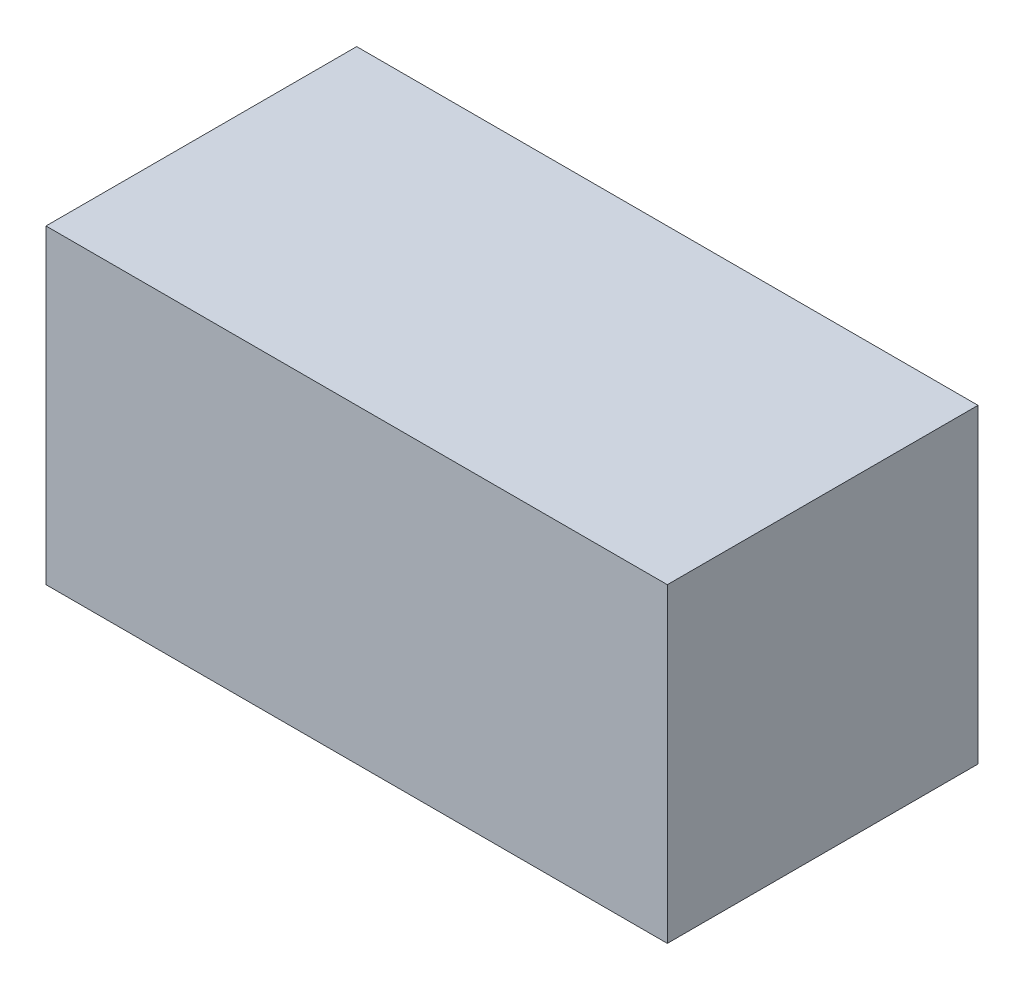
ISO-10303-21;
HEADER;
FILE_DESCRIPTION(('STEP AP214'),'2;1');
FILE_NAME('part.step','',(''),(''),'','','');
FILE_SCHEMA(('AUTOMOTIVE_DESIGN { 1 0 10303 214 1 1 1 1 }'));
ENDSEC;
DATA;
#1=APPLICATION_CONTEXT('core data for automotive mechanical design processes');
#2=APPLICATION_PROTOCOL_DEFINITION('international standard','automotive_design',2000,#1);
#3=PRODUCT_CONTEXT('',#1,'mechanical');
#4=PRODUCT('Part','Part','',(#3));
#5=PRODUCT_RELATED_PRODUCT_CATEGORY('part','',(#4));
#6=PRODUCT_DEFINITION_FORMATION('','',#4);
#7=PRODUCT_DEFINITION_CONTEXT('part definition',#1,'design');
#8=PRODUCT_DEFINITION('design','',#6,#7);
#9=PRODUCT_DEFINITION_SHAPE('','',#8);
#10=(LENGTH_UNIT() NAMED_UNIT(*) SI_UNIT(.MILLI.,.METRE.));
#11=(NAMED_UNIT(*) PLANE_ANGLE_UNIT() SI_UNIT($,.RADIAN.));
#12=(NAMED_UNIT(*) SI_UNIT($,.STERADIAN.) SOLID_ANGLE_UNIT());
#13=UNCERTAINTY_MEASURE_WITH_UNIT(LENGTH_MEASURE(1.E-05),#10,'distance_accuracy_value','');
#14=(GEOMETRIC_REPRESENTATION_CONTEXT(3) GLOBAL_UNCERTAINTY_ASSIGNED_CONTEXT((#13)) GLOBAL_UNIT_ASSIGNED_CONTEXT((#10,
#11,#12)) REPRESENTATION_CONTEXT('',''));
#15=CARTESIAN_POINT('',(0.,0.,0.));
#16=DIRECTION('',(0.,0.,1.));
#17=DIRECTION('',(1.,0.,0.));
#18=AXIS2_PLACEMENT_3D('',#15,#16,#17);
#19=CARTESIAN_POINT('',(-10.,5.,5.));
#20=DIRECTION('',(1.,0.,0.));
#21=DIRECTION('',(0.,0.,-1.));
#22=AXIS2_PLACEMENT_3D('',#19,#20,#21);
#23=PLANE('',#22);
#24=DIRECTION('',(0.,0.,1.));
#25=VECTOR('',#24,1.);
#26=CARTESIAN_POINT('',(-10.,-5.,5.));
#27=LINE('',#26,#25);
#28=CARTESIAN_POINT('',(-10.,-5.,-5.));
#29=VERTEX_POINT('',#28);
#30=CARTESIAN_POINT('',(-10.,-5.,5.));
#31=VERTEX_POINT('',#30);
#32=EDGE_CURVE('E96',#29,#31,#27,.T.);
#33=ORIENTED_EDGE('',*,*,#32,.T.);
#34=DIRECTION('',(0.,-1.,0.));
#35=VECTOR('',#34,1.);
#36=CARTESIAN_POINT('',(-10.,5.,5.));
#37=LINE('',#36,#35);
#38=CARTESIAN_POINT('',(-10.,5.,5.));
#39=VERTEX_POINT('',#38);
#40=EDGE_CURVE('E11',#39,#31,#37,.T.);
#41=ORIENTED_EDGE('',*,*,#40,.F.);
#42=DIRECTION('',(0.,0.,1.));
#43=VECTOR('',#42,1.);
#44=CARTESIAN_POINT('',(-10.,5.,5.));
#45=LINE('',#44,#43);
#46=CARTESIAN_POINT('',(-10.,5.,-5.));
#47=VERTEX_POINT('',#46);
#48=EDGE_CURVE('E84',#47,#39,#45,.T.);
#49=ORIENTED_EDGE('',*,*,#48,.F.);
#50=DIRECTION('',(0.,-1.,0.));
#51=VECTOR('',#50,1.);
#52=CARTESIAN_POINT('',(-10.,5.,-5.));
#53=LINE('',#52,#51);
#54=EDGE_CURVE('E92',#47,#29,#53,.T.);
#55=ORIENTED_EDGE('',*,*,#54,.T.);
#56=EDGE_LOOP('',(#33,#41,#49,#55));
#57=FACE_BOUND('',#56,.T.);
#58=ADVANCED_FACE('F33',(#57),#23,.F.);
#59=CARTESIAN_POINT('',(10.,5.,5.));
#60=DIRECTION('',(0.,0.,-1.));
#61=DIRECTION('',(-1.,0.,0.));
#62=AXIS2_PLACEMENT_3D('',#59,#60,#61);
#63=PLANE('',#62);
#64=DIRECTION('',(1.,0.,0.));
#65=VECTOR('',#64,1.);
#66=CARTESIAN_POINT('',(10.,-5.,5.));
#67=LINE('',#66,#65);
#68=CARTESIAN_POINT('',(10.,-5.,5.));
#69=VERTEX_POINT('',#68);
#70=EDGE_CURVE('E88',#31,#69,#67,.T.);
#71=ORIENTED_EDGE('',*,*,#70,.T.);
#72=DIRECTION('',(0.,-1.,0.));
#73=VECTOR('',#72,1.);
#74=CARTESIAN_POINT('',(10.,5.,5.));
#75=LINE('',#74,#73);
#76=CARTESIAN_POINT('',(10.,5.,5.));
#77=VERTEX_POINT('',#76);
#78=EDGE_CURVE('E41',#77,#69,#75,.T.);
#79=ORIENTED_EDGE('',*,*,#78,.F.);
#80=DIRECTION('',(1.,0.,0.));
#81=VECTOR('',#80,1.);
#82=CARTESIAN_POINT('',(10.,5.,5.));
#83=LINE('',#82,#81);
#84=EDGE_CURVE('E79',#39,#77,#83,.T.);
#85=ORIENTED_EDGE('',*,*,#84,.F.);
#86=ORIENTED_EDGE('',*,*,#40,.T.);
#87=EDGE_LOOP('',(#71,#79,#85,#86));
#88=FACE_BOUND('',#87,.T.);
#89=ADVANCED_FACE('F87',(#88),#63,.F.);
#90=CARTESIAN_POINT('',(10.,5.,5.));
#91=DIRECTION('',(-1.,0.,0.));
#92=DIRECTION('',(0.,0.,1.));
#93=AXIS2_PLACEMENT_3D('',#90,#91,#92);
#94=PLANE('',#93);
#95=DIRECTION('',(0.,0.,-1.));
#96=VECTOR('',#95,1.);
#97=CARTESIAN_POINT('',(10.,-5.,5.));
#98=LINE('',#97,#96);
#99=CARTESIAN_POINT('',(10.,-5.,-5.));
#100=VERTEX_POINT('',#99);
#101=EDGE_CURVE('E66',#69,#100,#98,.T.);
#102=ORIENTED_EDGE('',*,*,#101,.T.);
#103=DIRECTION('',(0.,-1.,0.));
#104=VECTOR('',#103,1.);
#105=CARTESIAN_POINT('',(10.,5.,-5.));
#106=LINE('',#105,#104);
#107=CARTESIAN_POINT('',(10.,5.,-5.));
#108=VERTEX_POINT('',#107);
#109=EDGE_CURVE('E89',#108,#100,#106,.T.);
#110=ORIENTED_EDGE('',*,*,#109,.F.);
#111=DIRECTION('',(0.,0.,-1.));
#112=VECTOR('',#111,1.);
#113=CARTESIAN_POINT('',(10.,5.,5.));
#114=LINE('',#113,#112);
#115=EDGE_CURVE('E82',#77,#108,#114,.T.);
#116=ORIENTED_EDGE('',*,*,#115,.F.);
#117=ORIENTED_EDGE('',*,*,#78,.T.);
#118=EDGE_LOOP('',(#102,#110,#116,#117));
#119=FACE_BOUND('',#118,.T.);
#120=ADVANCED_FACE('F90',(#119),#94,.F.);
#121=CARTESIAN_POINT('',(10.,5.,-5.));
#122=DIRECTION('',(0.,0.,1.));
#123=DIRECTION('',(1.,0.,0.));
#124=AXIS2_PLACEMENT_3D('',#121,#122,#123);
#125=PLANE('',#124);
#126=DIRECTION('',(-1.,0.,0.));
#127=VECTOR('',#126,1.);
#128=CARTESIAN_POINT('',(10.,-5.,-5.));
#129=LINE('',#128,#127);
#130=EDGE_CURVE('E72',#100,#29,#129,.T.);
#131=ORIENTED_EDGE('',*,*,#130,.T.);
#132=ORIENTED_EDGE('',*,*,#54,.F.);
#133=DIRECTION('',(-1.,0.,0.));
#134=VECTOR('',#133,1.);
#135=CARTESIAN_POINT('',(10.,5.,-5.));
#136=LINE('',#135,#134);
#137=EDGE_CURVE('E49',#108,#47,#136,.T.);
#138=ORIENTED_EDGE('',*,*,#137,.F.);
#139=ORIENTED_EDGE('',*,*,#109,.T.);
#140=EDGE_LOOP('',(#131,#132,#138,#139));
#141=FACE_BOUND('',#140,.T.);
#142=ADVANCED_FACE('F103',(#141),#125,.F.);
#143=CARTESIAN_POINT('',(0.,5.,0.));
#144=DIRECTION('',(0.,1.,0.));
#145=DIRECTION('',(0.,0.,1.));
#146=AXIS2_PLACEMENT_3D('',#143,#144,#145);
#147=PLANE('',#146);
#148=ORIENTED_EDGE('',*,*,#48,.T.);
#149=ORIENTED_EDGE('',*,*,#84,.T.);
#150=ORIENTED_EDGE('',*,*,#115,.T.);
#151=ORIENTED_EDGE('',*,*,#137,.T.);
#152=EDGE_LOOP('',(#148,#149,#150,#151));
#153=FACE_BOUND('',#152,.T.);
#154=ADVANCED_FACE('F80',(#153),#147,.T.);
#155=CARTESIAN_POINT('',(0.,-5.,0.));
#156=DIRECTION('',(0.,1.,0.));
#157=DIRECTION('',(0.,0.,1.));
#158=AXIS2_PLACEMENT_3D('',#155,#156,#157);
#159=PLANE('',#158);
#160=ORIENTED_EDGE('',*,*,#32,.F.);
#161=ORIENTED_EDGE('',*,*,#130,.F.);
#162=ORIENTED_EDGE('',*,*,#101,.F.);
#163=ORIENTED_EDGE('',*,*,#70,.F.);
#164=EDGE_LOOP('',(#160,#161,#162,#163));
#165=FACE_BOUND('',#164,.T.);
#166=ADVANCED_FACE('F106',(#165),#159,.F.);
#167=CLOSED_SHELL('',(#58,#89,#120,#142,#154,#166));
#168=MANIFOLD_SOLID_BREP('B2',#167);
#169=ADVANCED_BREP_SHAPE_REPRESENTATION('',(#18,#168),#14);
#170=SHAPE_DEFINITION_REPRESENTATION(#9,#169);
ENDSEC;
END-ISO-10303-21;
